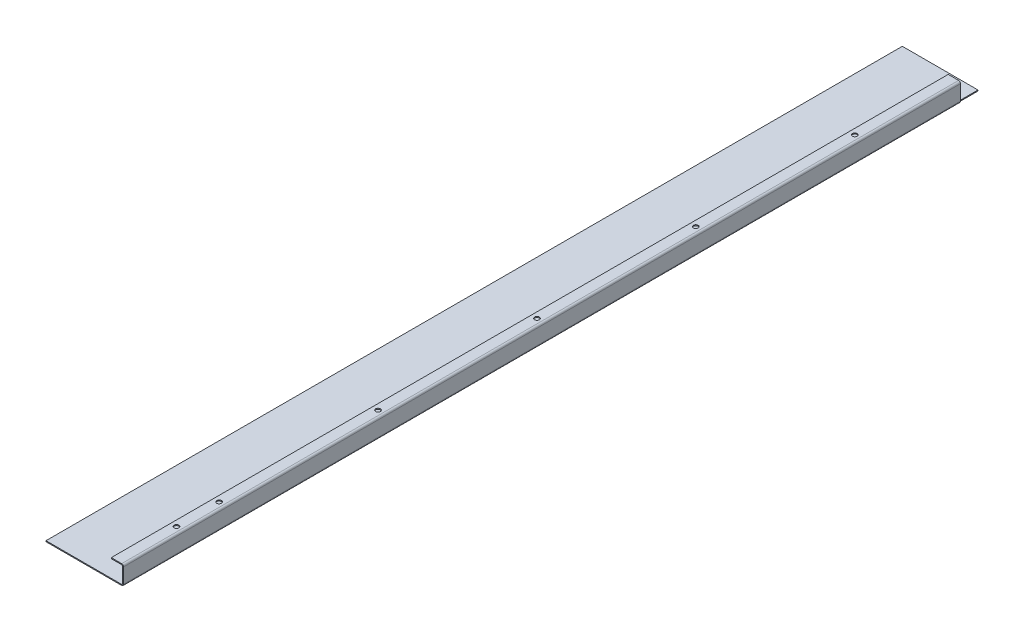
ISO-10303-21;
HEADER;
FILE_DESCRIPTION(('STEP AP214'),'2;1');
FILE_NAME('part.step','',(''),(''),'','','');
FILE_SCHEMA(('AUTOMOTIVE_DESIGN { 1 0 10303 214 1 1 1 1 }'));
ENDSEC;
DATA;
#1=APPLICATION_CONTEXT('core data for automotive mechanical design processes');
#2=APPLICATION_PROTOCOL_DEFINITION('international standard','automotive_design',2000,#1);
#3=PRODUCT_CONTEXT('',#1,'mechanical');
#4=PRODUCT('Part','Part','',(#3));
#5=PRODUCT_RELATED_PRODUCT_CATEGORY('part','',(#4));
#6=PRODUCT_DEFINITION_FORMATION('','',#4);
#7=PRODUCT_DEFINITION_CONTEXT('part definition',#1,'design');
#8=PRODUCT_DEFINITION('design','',#6,#7);
#9=PRODUCT_DEFINITION_SHAPE('','',#8);
#10=(LENGTH_UNIT() NAMED_UNIT(*) SI_UNIT(.MILLI.,.METRE.));
#11=(NAMED_UNIT(*) PLANE_ANGLE_UNIT() SI_UNIT($,.RADIAN.));
#12=(NAMED_UNIT(*) SI_UNIT($,.STERADIAN.) SOLID_ANGLE_UNIT());
#13=UNCERTAINTY_MEASURE_WITH_UNIT(LENGTH_MEASURE(1.E-05),#10,'distance_accuracy_value','');
#14=(GEOMETRIC_REPRESENTATION_CONTEXT(3) GLOBAL_UNCERTAINTY_ASSIGNED_CONTEXT((#13)) GLOBAL_UNIT_ASSIGNED_CONTEXT((#10,
#11,#12)) REPRESENTATION_CONTEXT('',''));
#15=CARTESIAN_POINT('',(0.,0.,0.));
#16=DIRECTION('',(0.,0.,1.));
#17=DIRECTION('',(1.,0.,0.));
#18=AXIS2_PLACEMENT_3D('',#15,#16,#17);
#19=CARTESIAN_POINT('',(82.,-3.02959534033787E-13,0.));
#20=DIRECTION('',(-1.,0.,0.));
#21=DIRECTION('',(0.,-1.,0.));
#22=AXIS2_PLACEMENT_3D('',#19,#20,#21);
#23=PLANE('',#22);
#24=DIRECTION('',(0.,-1.,0.));
#25=VECTOR('',#24,1.);
#26=CARTESIAN_POINT('',(81.9999999999998,0.,-884.7));
#27=LINE('',#26,#25);
#28=CARTESIAN_POINT('',(81.9999999999999,17.,-884.7));
#29=VERTEX_POINT('',#28);
#30=CARTESIAN_POINT('',(81.9999999999997,0.999999999999931,-884.7));
#31=VERTEX_POINT('',#30);
#32=EDGE_CURVE('E353',#29,#31,#27,.T.);
#33=ORIENTED_EDGE('',*,*,#32,.F.);
#34=DIRECTION('',(0.,0.,-1.));
#35=VECTOR('',#34,1.);
#36=CARTESIAN_POINT('',(82.,17.,-905.2));
#37=LINE('',#36,#35);
#38=CARTESIAN_POINT('',(82.,17.,0.));
#39=VERTEX_POINT('',#38);
#40=EDGE_CURVE('E218',#29,#39,#37,.F.);
#41=ORIENTED_EDGE('',*,*,#40,.T.);
#42=DIRECTION('',(0.,-1.,0.));
#43=VECTOR('',#42,1.);
#44=CARTESIAN_POINT('',(82.,-3.02959534033787E-13,0.));
#45=LINE('',#44,#43);
#46=CARTESIAN_POINT('',(82.,0.999999999999983,0.));
#47=VERTEX_POINT('',#46);
#48=EDGE_CURVE('E231',#39,#47,#45,.T.);
#49=ORIENTED_EDGE('',*,*,#48,.T.);
#50=DIRECTION('',(0.,0.,-1.));
#51=VECTOR('',#50,1.);
#52=CARTESIAN_POINT('',(82.,0.999999999999997,0.));
#53=LINE('',#52,#51);
#54=EDGE_CURVE('E237',#31,#47,#53,.F.);
#55=ORIENTED_EDGE('',*,*,#54,.F.);
#56=EDGE_LOOP('',(#33,#41,#49,#55));
#57=FACE_BOUND('',#56,.T.);
#58=ADVANCED_FACE('F80',(#57),#23,.F.);
#59=CARTESIAN_POINT('',(81.,-2.99468052694944E-13,0.));
#60=DIRECTION('',(-1.,0.,0.));
#61=DIRECTION('',(0.,-1.,0.));
#62=AXIS2_PLACEMENT_3D('',#59,#60,#61);
#63=PLANE('',#62);
#64=DIRECTION('',(0.,0.,-1.));
#65=VECTOR('',#64,1.);
#66=CARTESIAN_POINT('',(81.,17.,-905.2));
#67=LINE('',#66,#65);
#68=CARTESIAN_POINT('',(81.,17.,-884.7));
#69=VERTEX_POINT('',#68);
#70=CARTESIAN_POINT('',(81.,17.,0.));
#71=VERTEX_POINT('',#70);
#72=EDGE_CURVE('E225',#69,#71,#67,.F.);
#73=ORIENTED_EDGE('',*,*,#72,.F.);
#74=DIRECTION('',(0.,-1.,0.));
#75=VECTOR('',#74,1.);
#76=CARTESIAN_POINT('',(80.9999999999998,-2.99307484610677E-13,-884.7));
#77=LINE('',#76,#75);
#78=CARTESIAN_POINT('',(80.9999999999998,0.999999999999987,-884.7));
#79=VERTEX_POINT('',#78);
#80=EDGE_CURVE('E354',#69,#79,#77,.T.);
#81=ORIENTED_EDGE('',*,*,#80,.T.);
#82=DIRECTION('',(0.,0.,-1.));
#83=VECTOR('',#82,1.);
#84=CARTESIAN_POINT('',(81.,1.,0.));
#85=LINE('',#84,#83);
#86=CARTESIAN_POINT('',(81.,0.999999999999987,0.));
#87=VERTEX_POINT('',#86);
#88=EDGE_CURVE('E239',#87,#79,#85,.T.);
#89=ORIENTED_EDGE('',*,*,#88,.F.);
#90=DIRECTION('',(0.,1.,0.));
#91=VECTOR('',#90,1.);
#92=CARTESIAN_POINT('',(81.,0.,0.));
#93=LINE('',#92,#91);
#94=EDGE_CURVE('E235',#71,#87,#93,.F.);
#95=ORIENTED_EDGE('',*,*,#94,.F.);
#96=EDGE_LOOP('',(#73,#81,#89,#95));
#97=FACE_BOUND('',#96,.T.);
#98=ADVANCED_FACE('F401',(#97),#63,.T.);
#99=CARTESIAN_POINT('',(79.9999999999999,0.999999999999991,-905.2));
#100=DIRECTION('',(0.,0.,-1.));
#101=DIRECTION('',(1.,0.,0.));
#102=AXIS2_PLACEMENT_3D('',#99,#100,#101);
#103=CYLINDRICAL_SURFACE('',#102,2.00000000000008);
#104=DIRECTION('',(0.,0.,-1.));
#105=VECTOR('',#104,1.);
#106=CARTESIAN_POINT('',(79.9999999999997,-1.00000000000009,-905.2));
#107=LINE('',#106,#105);
#108=CARTESIAN_POINT('',(79.9999999999997,-1.00000000000009,-884.7));
#109=VERTEX_POINT('',#108);
#110=CARTESIAN_POINT('',(79.9999999999998,-1.,0.));
#111=VERTEX_POINT('',#110);
#112=EDGE_CURVE('E105',#109,#111,#107,.F.);
#113=ORIENTED_EDGE('',*,*,#112,.F.);
#114=CARTESIAN_POINT('',(79.9999999999997,0.999999999999907,-884.7));
#115=DIRECTION('',(0.,0.,1.));
#116=DIRECTION('',(1.,0.,0.));
#117=AXIS2_PLACEMENT_3D('',#114,#115,#116);
#118=CIRCLE('',#117,2.);
#119=EDGE_CURVE('E325',#109,#31,#118,.T.);
#120=ORIENTED_EDGE('',*,*,#119,.T.);
#121=ORIENTED_EDGE('',*,*,#54,.T.);
#122=CARTESIAN_POINT('',(79.9999999999999,0.999999999999991,0.));
#123=DIRECTION('',(0.,0.,-1.));
#124=DIRECTION('',(-1.,0.,0.));
#125=AXIS2_PLACEMENT_3D('',#122,#123,#124);
#126=CIRCLE('',#125,2.00000000000008);
#127=EDGE_CURVE('E246',#111,#47,#126,.F.);
#128=ORIENTED_EDGE('',*,*,#127,.F.);
#129=EDGE_LOOP('',(#113,#120,#121,#128));
#130=FACE_BOUND('',#129,.T.);
#131=ADVANCED_FACE('F407',(#130),#103,.T.);
#132=CARTESIAN_POINT('',(79.9999999999999,0.999999999999991,-905.2));
#133=DIRECTION('',(0.,0.,-1.));
#134=DIRECTION('',(1.,0.,0.));
#135=AXIS2_PLACEMENT_3D('',#132,#133,#134);
#136=CYLINDRICAL_SURFACE('',#135,1.00000000000008);
#137=CARTESIAN_POINT('',(79.9999999999997,0.999999999999907,-884.7));
#138=DIRECTION('',(0.,0.,1.));
#139=DIRECTION('',(1.,0.,0.));
#140=AXIS2_PLACEMENT_3D('',#137,#138,#139);
#141=CIRCLE('',#140,1.);
#142=CARTESIAN_POINT('',(79.9999999999998,0.,-884.7));
#143=VERTEX_POINT('',#142);
#144=EDGE_CURVE('E331',#143,#79,#141,.T.);
#145=ORIENTED_EDGE('',*,*,#144,.F.);
#146=DIRECTION('',(0.,0.,-1.));
#147=VECTOR('',#146,1.);
#148=CARTESIAN_POINT('',(79.9999999999998,0.,-905.2));
#149=LINE('',#148,#147);
#150=CARTESIAN_POINT('',(79.9999999999998,0.,0.));
#151=VERTEX_POINT('',#150);
#152=EDGE_CURVE('E234',#143,#151,#149,.F.);
#153=ORIENTED_EDGE('',*,*,#152,.T.);
#154=CARTESIAN_POINT('',(79.9999999999999,0.999999999999991,0.));
#155=DIRECTION('',(0.,0.,-1.));
#156=DIRECTION('',(-1.,0.,0.));
#157=AXIS2_PLACEMENT_3D('',#154,#155,#156);
#158=CIRCLE('',#157,1.00000000000008);
#159=EDGE_CURVE('E250',#151,#87,#158,.F.);
#160=ORIENTED_EDGE('',*,*,#159,.T.);
#161=ORIENTED_EDGE('',*,*,#88,.T.);
#162=EDGE_LOOP('',(#145,#153,#160,#161));
#163=FACE_BOUND('',#162,.T.);
#164=ADVANCED_FACE('F422',(#163),#136,.F.);
#165=CARTESIAN_POINT('',(80.,17.,-905.2));
#166=DIRECTION('',(0.,0.,-1.));
#167=DIRECTION('',(0.,1.,0.));
#168=AXIS2_PLACEMENT_3D('',#165,#166,#167);
#169=CYLINDRICAL_SURFACE('',#168,2.);
#170=ORIENTED_EDGE('',*,*,#40,.F.);
#171=CARTESIAN_POINT('',(80.,17.,-884.7));
#172=DIRECTION('',(0.,0.,1.));
#173=DIRECTION('',(1.,0.,0.));
#174=AXIS2_PLACEMENT_3D('',#171,#172,#173);
#175=CIRCLE('',#174,2.);
#176=CARTESIAN_POINT('',(79.9999999999997,19.0000000000001,-884.7));
#177=VERTEX_POINT('',#176);
#178=EDGE_CURVE('E184',#29,#177,#175,.T.);
#179=ORIENTED_EDGE('',*,*,#178,.T.);
#180=DIRECTION('',(0.,0.,-1.));
#181=VECTOR('',#180,1.);
#182=CARTESIAN_POINT('',(80.0000000000001,19.,0.));
#183=LINE('',#182,#181);
#184=CARTESIAN_POINT('',(80.,19.,0.));
#185=VERTEX_POINT('',#184);
#186=EDGE_CURVE('E210',#177,#185,#183,.F.);
#187=ORIENTED_EDGE('',*,*,#186,.T.);
#188=CARTESIAN_POINT('',(80.,17.,0.));
#189=DIRECTION('',(0.,0.,-1.));
#190=DIRECTION('',(-1.,0.,0.));
#191=AXIS2_PLACEMENT_3D('',#188,#189,#190);
#192=CIRCLE('',#191,2.);
#193=EDGE_CURVE('E220',#39,#185,#192,.F.);
#194=ORIENTED_EDGE('',*,*,#193,.F.);
#195=EDGE_LOOP('',(#170,#179,#187,#194));
#196=FACE_BOUND('',#195,.T.);
#197=ADVANCED_FACE('F426',(#196),#169,.T.);
#198=CARTESIAN_POINT('',(80.,17.,-905.2));
#199=DIRECTION('',(0.,0.,-1.));
#200=DIRECTION('',(0.,1.,0.));
#201=AXIS2_PLACEMENT_3D('',#198,#199,#200);
#202=CYLINDRICAL_SURFACE('',#201,1.);
#203=CARTESIAN_POINT('',(80.,17.,-884.7));
#204=DIRECTION('',(0.,0.,1.));
#205=DIRECTION('',(1.,0.,0.));
#206=AXIS2_PLACEMENT_3D('',#203,#204,#205);
#207=CIRCLE('',#206,1.);
#208=CARTESIAN_POINT('',(80.0000000000001,18.,-884.7));
#209=VERTEX_POINT('',#208);
#210=EDGE_CURVE('E185',#69,#209,#207,.T.);
#211=ORIENTED_EDGE('',*,*,#210,.F.);
#212=ORIENTED_EDGE('',*,*,#72,.T.);
#213=CARTESIAN_POINT('',(80.,17.,0.));
#214=DIRECTION('',(0.,0.,-1.));
#215=DIRECTION('',(-1.,0.,0.));
#216=AXIS2_PLACEMENT_3D('',#213,#214,#215);
#217=CIRCLE('',#216,1.);
#218=CARTESIAN_POINT('',(80.,18.,0.));
#219=VERTEX_POINT('',#218);
#220=EDGE_CURVE('E209',#71,#219,#217,.F.);
#221=ORIENTED_EDGE('',*,*,#220,.T.);
#222=DIRECTION('',(0.,0.,-1.));
#223=VECTOR('',#222,1.);
#224=CARTESIAN_POINT('',(80.0000000000001,18.,0.));
#225=LINE('',#224,#223);
#226=EDGE_CURVE('E201',#219,#209,#225,.T.);
#227=ORIENTED_EDGE('',*,*,#226,.T.);
#228=EDGE_LOOP('',(#211,#212,#221,#227));
#229=FACE_BOUND('',#228,.T.);
#230=ADVANCED_FACE('F207',(#229),#202,.F.);
#231=CARTESIAN_POINT('',(1.40823756520345E-13,19.0000000000006,0.));
#232=DIRECTION('',(0.,-1.,0.));
#233=DIRECTION('',(1.,0.,0.));
#234=AXIS2_PLACEMENT_3D('',#231,#232,#233);
#235=PLANE('',#234);
#236=CARTESIAN_POINT('',(74.9999999999785,19.,-780.));
#237=DIRECTION('',(0.,1.,0.));
#238=DIRECTION('',(-1.,0.,0.));
#239=AXIS2_PLACEMENT_3D('',#236,#237,#238);
#240=CIRCLE('',#239,2.5);
#241=CARTESIAN_POINT('',(72.4999999999785,19.0000000000001,-780.));
#242=VERTEX_POINT('',#241);
#243=EDGE_CURVE('E322',#242,#242,#240,.T.);
#244=ORIENTED_EDGE('',*,*,#243,.F.);
#245=EDGE_LOOP('',(#244));
#246=FACE_BOUND('',#245,.T.);
#247=CARTESIAN_POINT('',(74.9999999999839,19.,-612.));
#248=DIRECTION('',(0.,1.,0.));
#249=DIRECTION('',(-1.,0.,0.));
#250=AXIS2_PLACEMENT_3D('',#247,#248,#249);
#251=CIRCLE('',#250,2.5);
#252=CARTESIAN_POINT('',(72.4999999999839,19.0000000000001,-612.));
#253=VERTEX_POINT('',#252);
#254=EDGE_CURVE('E324',#253,#253,#251,.T.);
#255=ORIENTED_EDGE('',*,*,#254,.F.);
#256=EDGE_LOOP('',(#255));
#257=FACE_BOUND('',#256,.T.);
#258=CARTESIAN_POINT('',(74.9999999999892,19.,-444.));
#259=DIRECTION('',(0.,1.,0.));
#260=DIRECTION('',(-1.,0.,0.));
#261=AXIS2_PLACEMENT_3D('',#258,#259,#260);
#262=CIRCLE('',#261,2.5);
#263=CARTESIAN_POINT('',(72.4999999999892,19.0000000000001,-444.));
#264=VERTEX_POINT('',#263);
#265=EDGE_CURVE('E328',#264,#264,#262,.T.);
#266=ORIENTED_EDGE('',*,*,#265,.F.);
#267=EDGE_LOOP('',(#266));
#268=FACE_BOUND('',#267,.T.);
#269=CARTESIAN_POINT('',(74.9999999999946,19.,-276.));
#270=DIRECTION('',(0.,1.,0.));
#271=DIRECTION('',(-1.,0.,0.));
#272=AXIS2_PLACEMENT_3D('',#269,#270,#271);
#273=CIRCLE('',#272,2.50000000000001);
#274=CARTESIAN_POINT('',(72.4999999999946,19.0000000000001,-276.));
#275=VERTEX_POINT('',#274);
#276=EDGE_CURVE('E372',#275,#275,#273,.T.);
#277=ORIENTED_EDGE('',*,*,#276,.F.);
#278=EDGE_LOOP('',(#277));
#279=FACE_BOUND('',#278,.T.);
#280=CARTESIAN_POINT('',(74.9999999999999,19.,-108.));
#281=DIRECTION('',(0.,1.,0.));
#282=DIRECTION('',(-1.,0.,0.));
#283=AXIS2_PLACEMENT_3D('',#280,#281,#282);
#284=CIRCLE('',#283,2.50000000000001);
#285=CARTESIAN_POINT('',(72.4999999999999,19.0000000000001,-108.));
#286=VERTEX_POINT('',#285);
#287=EDGE_CURVE('E369',#286,#286,#284,.T.);
#288=ORIENTED_EDGE('',*,*,#287,.F.);
#289=EDGE_LOOP('',(#288));
#290=FACE_BOUND('',#289,.T.);
#291=CARTESIAN_POINT('',(74.9999999999999,19.,-63.));
#292=DIRECTION('',(0.,1.,0.));
#293=DIRECTION('',(-1.,0.,0.));
#294=AXIS2_PLACEMENT_3D('',#291,#292,#293);
#295=CIRCLE('',#294,2.5);
#296=CARTESIAN_POINT('',(72.4999999999999,19.0000000000001,-63.));
#297=VERTEX_POINT('',#296);
#298=EDGE_CURVE('E282',#297,#297,#295,.T.);
#299=ORIENTED_EDGE('',*,*,#298,.F.);
#300=EDGE_LOOP('',(#299));
#301=FACE_BOUND('',#300,.T.);
#302=DIRECTION('',(1.,0.,0.));
#303=VECTOR('',#302,1.);
#304=CARTESIAN_POINT('',(-3.46944695195361E-13,19.0000000000004,-884.7));
#305=LINE('',#304,#303);
#306=CARTESIAN_POINT('',(68.9999999999999,19.0000000000001,-884.7));
#307=VERTEX_POINT('',#306);
#308=EDGE_CURVE('E181',#307,#177,#305,.T.);
#309=ORIENTED_EDGE('',*,*,#308,.F.);
#310=DIRECTION('',(0.,0.,1.));
#311=VECTOR('',#310,1.);
#312=CARTESIAN_POINT('',(69.0000000000001,19.0000000000001,0.));
#313=LINE('',#312,#311);
#314=CARTESIAN_POINT('',(69.0000000000001,19.0000000000001,0.));
#315=VERTEX_POINT('',#314);
#316=EDGE_CURVE('E340',#307,#315,#313,.T.);
#317=ORIENTED_EDGE('',*,*,#316,.T.);
#318=DIRECTION('',(1.,0.,0.));
#319=VECTOR('',#318,1.);
#320=CARTESIAN_POINT('',(1.40823756520345E-13,19.0000000000006,0.));
#321=LINE('',#320,#319);
#322=EDGE_CURVE('E337',#315,#185,#321,.T.);
#323=ORIENTED_EDGE('',*,*,#322,.T.);
#324=ORIENTED_EDGE('',*,*,#186,.F.);
#325=EDGE_LOOP('',(#309,#317,#323,#324));
#326=FACE_BOUND('',#325,.T.);
#327=ADVANCED_FACE('F303',(#246,#257,#268,#279,#290,#301,#326),#235,.F.);
#328=CARTESIAN_POINT('',(1.33680225758392E-13,18.0000000000006,0.));
#329=DIRECTION('',(0.,-1.,0.));
#330=DIRECTION('',(1.,0.,0.));
#331=AXIS2_PLACEMENT_3D('',#328,#329,#330);
#332=PLANE('',#331);
#333=CARTESIAN_POINT('',(74.9999999999999,18.,-63.));
#334=DIRECTION('',(0.,-1.,0.));
#335=DIRECTION('',(1.,0.,0.));
#336=AXIS2_PLACEMENT_3D('',#333,#334,#335);
#337=CIRCLE('',#336,2.5);
#338=CARTESIAN_POINT('',(77.4999999999999,18.,-63.));
#339=VERTEX_POINT('',#338);
#340=EDGE_CURVE('E84',#339,#339,#337,.T.);
#341=ORIENTED_EDGE('',*,*,#340,.F.);
#342=EDGE_LOOP('',(#341));
#343=FACE_BOUND('',#342,.T.);
#344=CARTESIAN_POINT('',(74.9999999999999,18.,-108.));
#345=DIRECTION('',(0.,-1.,0.));
#346=DIRECTION('',(1.,0.,0.));
#347=AXIS2_PLACEMENT_3D('',#344,#345,#346);
#348=CIRCLE('',#347,2.50000000000001);
#349=CARTESIAN_POINT('',(77.5,18.,-108.));
#350=VERTEX_POINT('',#349);
#351=EDGE_CURVE('E290',#350,#350,#348,.T.);
#352=ORIENTED_EDGE('',*,*,#351,.F.);
#353=EDGE_LOOP('',(#352));
#354=FACE_BOUND('',#353,.T.);
#355=CARTESIAN_POINT('',(74.9999999999946,18.,-276.));
#356=DIRECTION('',(0.,-1.,0.));
#357=DIRECTION('',(1.,0.,0.));
#358=AXIS2_PLACEMENT_3D('',#355,#356,#357);
#359=CIRCLE('',#358,2.50000000000001);
#360=CARTESIAN_POINT('',(77.4999999999946,18.,-276.));
#361=VERTEX_POINT('',#360);
#362=EDGE_CURVE('E288',#361,#361,#359,.T.);
#363=ORIENTED_EDGE('',*,*,#362,.F.);
#364=EDGE_LOOP('',(#363));
#365=FACE_BOUND('',#364,.T.);
#366=CARTESIAN_POINT('',(74.9999999999892,18.,-444.));
#367=DIRECTION('',(0.,-1.,0.));
#368=DIRECTION('',(1.,0.,0.));
#369=AXIS2_PLACEMENT_3D('',#366,#367,#368);
#370=CIRCLE('',#369,2.5);
#371=CARTESIAN_POINT('',(77.4999999999892,18.,-444.));
#372=VERTEX_POINT('',#371);
#373=EDGE_CURVE('E285',#372,#372,#370,.T.);
#374=ORIENTED_EDGE('',*,*,#373,.F.);
#375=EDGE_LOOP('',(#374));
#376=FACE_BOUND('',#375,.T.);
#377=CARTESIAN_POINT('',(74.9999999999839,18.,-612.));
#378=DIRECTION('',(0.,-1.,0.));
#379=DIRECTION('',(1.,0.,0.));
#380=AXIS2_PLACEMENT_3D('',#377,#378,#379);
#381=CIRCLE('',#380,2.5);
#382=CARTESIAN_POINT('',(77.4999999999839,18.,-612.));
#383=VERTEX_POINT('',#382);
#384=EDGE_CURVE('E281',#383,#383,#381,.T.);
#385=ORIENTED_EDGE('',*,*,#384,.F.);
#386=EDGE_LOOP('',(#385));
#387=FACE_BOUND('',#386,.T.);
#388=CARTESIAN_POINT('',(74.9999999999785,18.,-780.));
#389=DIRECTION('',(0.,-1.,0.));
#390=DIRECTION('',(1.,0.,0.));
#391=AXIS2_PLACEMENT_3D('',#388,#389,#390);
#392=CIRCLE('',#391,2.5);
#393=CARTESIAN_POINT('',(77.4999999999785,18.,-780.));
#394=VERTEX_POINT('',#393);
#395=EDGE_CURVE('E278',#394,#394,#392,.T.);
#396=ORIENTED_EDGE('',*,*,#395,.F.);
#397=EDGE_LOOP('',(#396));
#398=FACE_BOUND('',#397,.T.);
#399=DIRECTION('',(0.,0.,-1.));
#400=VECTOR('',#399,1.);
#401=CARTESIAN_POINT('',(69.0000000000001,18.0000000000001,0.));
#402=LINE('',#401,#400);
#403=CARTESIAN_POINT('',(68.9999999999999,18.0000000000001,-884.7));
#404=VERTEX_POINT('',#403);
#405=CARTESIAN_POINT('',(69.0000000000001,18.0000000000001,0.));
#406=VERTEX_POINT('',#405);
#407=EDGE_CURVE('E203',#404,#406,#402,.F.);
#408=ORIENTED_EDGE('',*,*,#407,.F.);
#409=DIRECTION('',(1.,0.,0.));
#410=VECTOR('',#409,1.);
#411=CARTESIAN_POINT('',(1.33595742037108E-13,18.0000000000006,-884.7));
#412=LINE('',#411,#410);
#413=EDGE_CURVE('E97',#404,#209,#412,.T.);
#414=ORIENTED_EDGE('',*,*,#413,.T.);
#415=ORIENTED_EDGE('',*,*,#226,.F.);
#416=DIRECTION('',(-1.,0.,0.));
#417=VECTOR('',#416,1.);
#418=CARTESIAN_POINT('',(81.0000000000001,18.,0.));
#419=LINE('',#418,#417);
#420=EDGE_CURVE('E342',#406,#219,#419,.F.);
#421=ORIENTED_EDGE('',*,*,#420,.F.);
#422=EDGE_LOOP('',(#408,#414,#415,#421));
#423=FACE_BOUND('',#422,.T.);
#424=ADVANCED_FACE('F199',(#343,#354,#365,#376,#387,#398,#423),#332,.T.);
#425=CARTESIAN_POINT('',(69.0000000000001,19.0000000000001,0.));
#426=DIRECTION('',(1.,0.,0.));
#427=DIRECTION('',(0.,1.,0.));
#428=AXIS2_PLACEMENT_3D('',#425,#426,#427);
#429=PLANE('',#428);
#430=DIRECTION('',(0.,1.,0.));
#431=VECTOR('',#430,1.);
#432=CARTESIAN_POINT('',(68.9999999999999,19.0000000000001,-884.7));
#433=LINE('',#432,#431);
#434=EDGE_CURVE('E204',#307,#404,#433,.F.);
#435=ORIENTED_EDGE('',*,*,#434,.T.);
#436=ORIENTED_EDGE('',*,*,#407,.T.);
#437=DIRECTION('',(0.,-1.,0.));
#438=VECTOR('',#437,1.);
#439=CARTESIAN_POINT('',(69.0000000000001,19.0000000000001,0.));
#440=LINE('',#439,#438);
#441=EDGE_CURVE('E227',#315,#406,#440,.T.);
#442=ORIENTED_EDGE('',*,*,#441,.F.);
#443=ORIENTED_EDGE('',*,*,#316,.F.);
#444=EDGE_LOOP('',(#435,#436,#442,#443));
#445=FACE_BOUND('',#444,.T.);
#446=ADVANCED_FACE('F302',(#445),#429,.F.);
#447=CARTESIAN_POINT('',(82.,0.,0.));
#448=DIRECTION('',(0.,0.,-1.));
#449=DIRECTION('',(-1.,0.,0.));
#450=AXIS2_PLACEMENT_3D('',#447,#448,#449);
#451=PLANE('',#450);
#452=DIRECTION('',(1.,0.,0.));
#453=VECTOR('',#452,1.);
#454=CARTESIAN_POINT('',(81.,17.,0.));
#455=LINE('',#454,#453);
#456=EDGE_CURVE('E223',#71,#39,#455,.T.);
#457=ORIENTED_EDGE('',*,*,#456,.F.);
#458=ORIENTED_EDGE('',*,*,#94,.T.);
#459=DIRECTION('',(-1.,0.,0.));
#460=VECTOR('',#459,1.);
#461=CARTESIAN_POINT('',(82.,0.999999999999997,0.));
#462=LINE('',#461,#460);
#463=EDGE_CURVE('E230',#87,#47,#462,.F.);
#464=ORIENTED_EDGE('',*,*,#463,.T.);
#465=ORIENTED_EDGE('',*,*,#48,.F.);
#466=EDGE_LOOP('',(#457,#458,#464,#465));
#467=FACE_BOUND('',#466,.T.);
#468=ADVANCED_FACE('F415',(#467),#451,.F.);
#469=CARTESIAN_POINT('',(-1.94289029309402E-13,-1.,-905.2));
#470=DIRECTION('',(0.,0.,-1.));
#471=DIRECTION('',(-1.,0.,0.));
#472=AXIS2_PLACEMENT_3D('',#469,#470,#471);
#473=PLANE('',#472);
#474=DIRECTION('',(-1.,0.,0.));
#475=VECTOR('',#474,1.);
#476=CARTESIAN_POINT('',(-1.94289029309402E-13,0.,-905.2));
#477=LINE('',#476,#475);
#478=CARTESIAN_POINT('',(79.9999999999998,0.,-905.2));
#479=VERTEX_POINT('',#478);
#480=CARTESIAN_POINT('',(-1.94289029309402E-13,0.,-905.2));
#481=VERTEX_POINT('',#480);
#482=EDGE_CURVE('E266',#479,#481,#477,.T.);
#483=ORIENTED_EDGE('',*,*,#482,.F.);
#484=DIRECTION('',(0.,-1.,0.));
#485=VECTOR('',#484,1.);
#486=CARTESIAN_POINT('',(79.9999999999998,0.,-905.2));
#487=LINE('',#486,#485);
#488=CARTESIAN_POINT('',(79.9999999999997,-1.00000000000009,-905.2));
#489=VERTEX_POINT('',#488);
#490=EDGE_CURVE('E249',#479,#489,#487,.T.);
#491=ORIENTED_EDGE('',*,*,#490,.T.);
#492=DIRECTION('',(-1.,0.,0.));
#493=VECTOR('',#492,1.);
#494=CARTESIAN_POINT('',(-1.94289029309402E-13,-1.,-905.2));
#495=LINE('',#494,#493);
#496=CARTESIAN_POINT('',(-1.94289029309402E-13,-1.,-905.2));
#497=VERTEX_POINT('',#496);
#498=EDGE_CURVE('E269',#489,#497,#495,.T.);
#499=ORIENTED_EDGE('',*,*,#498,.T.);
#500=DIRECTION('',(0.,1.,0.));
#501=VECTOR('',#500,1.);
#502=CARTESIAN_POINT('',(-1.94289029309402E-13,-1.,-905.2));
#503=LINE('',#502,#501);
#504=EDGE_CURVE('E13',#497,#481,#503,.T.);
#505=ORIENTED_EDGE('',*,*,#504,.T.);
#506=EDGE_LOOP('',(#483,#491,#499,#505));
#507=FACE_BOUND('',#506,.T.);
#508=ADVANCED_FACE('F418',(#507),#473,.T.);
#509=CARTESIAN_POINT('',(0.,-1.,0.));
#510=DIRECTION('',(0.,-1.,0.));
#511=DIRECTION('',(0.,0.,-1.));
#512=AXIS2_PLACEMENT_3D('',#509,#510,#511);
#513=PLANE('',#512);
#514=ORIENTED_EDGE('',*,*,#498,.F.);
#515=EDGE_CURVE('E244',#489,#109,#107,.F.);
#516=ORIENTED_EDGE('',*,*,#515,.T.);
#517=ORIENTED_EDGE('',*,*,#112,.T.);
#518=DIRECTION('',(1.,0.,0.));
#519=VECTOR('',#518,1.);
#520=CARTESIAN_POINT('',(0.,-1.,0.));
#521=LINE('',#520,#519);
#522=CARTESIAN_POINT('',(0.,-1.,0.));
#523=VERTEX_POINT('',#522);
#524=EDGE_CURVE('E265',#523,#111,#521,.T.);
#525=ORIENTED_EDGE('',*,*,#524,.F.);
#526=DIRECTION('',(0.,0.,1.));
#527=VECTOR('',#526,1.);
#528=CARTESIAN_POINT('',(0.,-1.,0.));
#529=LINE('',#528,#527);
#530=EDGE_CURVE('E262',#497,#523,#529,.T.);
#531=ORIENTED_EDGE('',*,*,#530,.F.);
#532=EDGE_LOOP('',(#514,#516,#517,#525,#531));
#533=FACE_BOUND('',#532,.T.);
#534=ADVANCED_FACE('F433',(#533),#513,.T.);
#535=CARTESIAN_POINT('',(0.,0.,0.));
#536=DIRECTION('',(0.,-1.,0.));
#537=DIRECTION('',(0.,0.,-1.));
#538=AXIS2_PLACEMENT_3D('',#535,#536,#537);
#539=PLANE('',#538);
#540=EDGE_CURVE('E253',#479,#143,#149,.F.);
#541=ORIENTED_EDGE('',*,*,#540,.F.);
#542=ORIENTED_EDGE('',*,*,#482,.T.);
#543=DIRECTION('',(0.,0.,1.));
#544=VECTOR('',#543,1.);
#545=CARTESIAN_POINT('',(0.,0.,0.));
#546=LINE('',#545,#544);
#547=CARTESIAN_POINT('',(0.,0.,0.));
#548=VERTEX_POINT('',#547);
#549=EDGE_CURVE('E259',#481,#548,#546,.T.);
#550=ORIENTED_EDGE('',*,*,#549,.T.);
#551=DIRECTION('',(1.,0.,0.));
#552=VECTOR('',#551,1.);
#553=CARTESIAN_POINT('',(0.,0.,0.));
#554=LINE('',#553,#552);
#555=EDGE_CURVE('E273',#548,#151,#554,.T.);
#556=ORIENTED_EDGE('',*,*,#555,.T.);
#557=ORIENTED_EDGE('',*,*,#152,.F.);
#558=EDGE_LOOP('',(#541,#542,#550,#556,#557));
#559=FACE_BOUND('',#558,.T.);
#560=ADVANCED_FACE('F436',(#559),#539,.F.);
#561=CARTESIAN_POINT('',(0.,-1.,0.));
#562=DIRECTION('',(-1.,0.,0.));
#563=DIRECTION('',(0.,0.,1.));
#564=AXIS2_PLACEMENT_3D('',#561,#562,#563);
#565=PLANE('',#564);
#566=ORIENTED_EDGE('',*,*,#549,.F.);
#567=ORIENTED_EDGE('',*,*,#504,.F.);
#568=ORIENTED_EDGE('',*,*,#530,.T.);
#569=DIRECTION('',(0.,1.,0.));
#570=VECTOR('',#569,1.);
#571=CARTESIAN_POINT('',(0.,-1.,0.));
#572=LINE('',#571,#570);
#573=EDGE_CURVE('E89',#523,#548,#572,.T.);
#574=ORIENTED_EDGE('',*,*,#573,.T.);
#575=EDGE_LOOP('',(#566,#567,#568,#574));
#576=FACE_BOUND('',#575,.T.);
#577=ADVANCED_FACE('F82',(#576),#565,.T.);
#578=CARTESIAN_POINT('',(0.,-1.,0.));
#579=DIRECTION('',(0.,0.,1.));
#580=DIRECTION('',(1.,0.,0.));
#581=AXIS2_PLACEMENT_3D('',#578,#579,#580);
#582=PLANE('',#581);
#583=DIRECTION('',(0.,-1.,0.));
#584=VECTOR('',#583,1.);
#585=CARTESIAN_POINT('',(79.9999999999998,0.,0.));
#586=LINE('',#585,#584);
#587=EDGE_CURVE('E256',#151,#111,#586,.T.);
#588=ORIENTED_EDGE('',*,*,#587,.F.);
#589=ORIENTED_EDGE('',*,*,#555,.F.);
#590=ORIENTED_EDGE('',*,*,#573,.F.);
#591=ORIENTED_EDGE('',*,*,#524,.T.);
#592=EDGE_LOOP('',(#588,#589,#590,#591));
#593=FACE_BOUND('',#592,.T.);
#594=ADVANCED_FACE('F431',(#593),#582,.T.);
#595=CARTESIAN_POINT('',(79.9999999999999,0.999999999999991,0.));
#596=DIRECTION('',(0.,0.,1.));
#597=DIRECTION('',(1.,0.,0.));
#598=AXIS2_PLACEMENT_3D('',#595,#596,#597);
#599=PLANE('',#598);
#600=ORIENTED_EDGE('',*,*,#463,.F.);
#601=ORIENTED_EDGE('',*,*,#159,.F.);
#602=ORIENTED_EDGE('',*,*,#587,.T.);
#603=ORIENTED_EDGE('',*,*,#127,.T.);
#604=EDGE_LOOP('',(#600,#601,#602,#603));
#605=FACE_BOUND('',#604,.T.);
#606=ADVANCED_FACE('F428',(#605),#599,.T.);
#607=CARTESIAN_POINT('',(80.,17.,0.));
#608=DIRECTION('',(0.,0.,1.));
#609=DIRECTION('',(1.,0.,0.));
#610=AXIS2_PLACEMENT_3D('',#607,#608,#609);
#611=PLANE('',#610);
#612=DIRECTION('',(0.,-1.,0.));
#613=VECTOR('',#612,1.);
#614=CARTESIAN_POINT('',(80.0000000000001,19.,0.));
#615=LINE('',#614,#613);
#616=EDGE_CURVE('E211',#219,#185,#615,.F.);
#617=ORIENTED_EDGE('',*,*,#616,.F.);
#618=ORIENTED_EDGE('',*,*,#220,.F.);
#619=ORIENTED_EDGE('',*,*,#456,.T.);
#620=ORIENTED_EDGE('',*,*,#193,.T.);
#621=EDGE_LOOP('',(#617,#618,#619,#620));
#622=FACE_BOUND('',#621,.T.);
#623=ADVANCED_FACE('F412',(#622),#611,.T.);
#624=CARTESIAN_POINT('',(81.0000000000001,19.,0.));
#625=DIRECTION('',(0.,0.,-1.));
#626=DIRECTION('',(-1.,0.,0.));
#627=AXIS2_PLACEMENT_3D('',#624,#625,#626);
#628=PLANE('',#627);
#629=ORIENTED_EDGE('',*,*,#616,.T.);
#630=ORIENTED_EDGE('',*,*,#322,.F.);
#631=ORIENTED_EDGE('',*,*,#441,.T.);
#632=ORIENTED_EDGE('',*,*,#420,.T.);
#633=EDGE_LOOP('',(#629,#630,#631,#632));
#634=FACE_BOUND('',#633,.T.);
#635=ADVANCED_FACE('F318',(#634),#628,.F.);
#636=CARTESIAN_POINT('',(74.9999999999784,9.00000000000004,-780.));
#637=DIRECTION('',(0.,1.,0.));
#638=DIRECTION('',(-1.,0.,0.));
#639=AXIS2_PLACEMENT_3D('',#636,#637,#638);
#640=CYLINDRICAL_SURFACE('',#639,2.5);
#641=ORIENTED_EDGE('',*,*,#395,.T.);
#642=EDGE_LOOP('',(#641));
#643=FACE_BOUND('',#642,.T.);
#644=ORIENTED_EDGE('',*,*,#243,.T.);
#645=EDGE_LOOP('',(#644));
#646=FACE_BOUND('',#645,.T.);
#647=ADVANCED_FACE('F314',(#643,#646),#640,.F.);
#648=CARTESIAN_POINT('',(74.9999999999838,9.00000000000004,-612.));
#649=DIRECTION('',(0.,1.,0.));
#650=DIRECTION('',(-1.,0.,0.));
#651=AXIS2_PLACEMENT_3D('',#648,#649,#650);
#652=CYLINDRICAL_SURFACE('',#651,2.5);
#653=ORIENTED_EDGE('',*,*,#384,.T.);
#654=EDGE_LOOP('',(#653));
#655=FACE_BOUND('',#654,.T.);
#656=ORIENTED_EDGE('',*,*,#254,.T.);
#657=EDGE_LOOP('',(#656));
#658=FACE_BOUND('',#657,.T.);
#659=ADVANCED_FACE('F317',(#655,#658),#652,.F.);
#660=CARTESIAN_POINT('',(74.9999999999891,9.00000000000004,-444.));
#661=DIRECTION('',(0.,1.,0.));
#662=DIRECTION('',(-1.,0.,0.));
#663=AXIS2_PLACEMENT_3D('',#660,#661,#662);
#664=CYLINDRICAL_SURFACE('',#663,2.5);
#665=ORIENTED_EDGE('',*,*,#373,.T.);
#666=EDGE_LOOP('',(#665));
#667=FACE_BOUND('',#666,.T.);
#668=ORIENTED_EDGE('',*,*,#265,.T.);
#669=EDGE_LOOP('',(#668));
#670=FACE_BOUND('',#669,.T.);
#671=ADVANCED_FACE('F377',(#667,#670),#664,.F.);
#672=CARTESIAN_POINT('',(74.9999999999945,9.00000000000004,-276.));
#673=DIRECTION('',(0.,1.,0.));
#674=DIRECTION('',(-1.,0.,0.));
#675=AXIS2_PLACEMENT_3D('',#672,#673,#674);
#676=CYLINDRICAL_SURFACE('',#675,2.50000000000001);
#677=ORIENTED_EDGE('',*,*,#362,.T.);
#678=EDGE_LOOP('',(#677));
#679=FACE_BOUND('',#678,.T.);
#680=ORIENTED_EDGE('',*,*,#276,.T.);
#681=EDGE_LOOP('',(#680));
#682=FACE_BOUND('',#681,.T.);
#683=ADVANCED_FACE('F398',(#679,#682),#676,.F.);
#684=CARTESIAN_POINT('',(74.9999999999999,9.00000000000004,-108.));
#685=DIRECTION('',(0.,1.,0.));
#686=DIRECTION('',(-1.,0.,0.));
#687=AXIS2_PLACEMENT_3D('',#684,#685,#686);
#688=CYLINDRICAL_SURFACE('',#687,2.50000000000001);
#689=ORIENTED_EDGE('',*,*,#351,.T.);
#690=EDGE_LOOP('',(#689));
#691=FACE_BOUND('',#690,.T.);
#692=ORIENTED_EDGE('',*,*,#287,.T.);
#693=EDGE_LOOP('',(#692));
#694=FACE_BOUND('',#693,.T.);
#695=ADVANCED_FACE('F389',(#691,#694),#688,.F.);
#696=CARTESIAN_POINT('',(74.9999999999999,9.00000000000004,-63.));
#697=DIRECTION('',(0.,1.,0.));
#698=DIRECTION('',(-1.,0.,0.));
#699=AXIS2_PLACEMENT_3D('',#696,#697,#698);
#700=CYLINDRICAL_SURFACE('',#699,2.5);
#701=ORIENTED_EDGE('',*,*,#340,.T.);
#702=EDGE_LOOP('',(#701));
#703=FACE_BOUND('',#702,.T.);
#704=ORIENTED_EDGE('',*,*,#298,.T.);
#705=EDGE_LOOP('',(#704));
#706=FACE_BOUND('',#705,.T.);
#707=ADVANCED_FACE('F297',(#703,#706),#700,.F.);
#708=CARTESIAN_POINT('',(79.9999999999997,0.999999999999907,-884.7));
#709=DIRECTION('',(0.,0.,-1.));
#710=DIRECTION('',(-1.,0.,0.));
#711=AXIS2_PLACEMENT_3D('',#708,#709,#710);
#712=PLANE('',#711);
#713=DIRECTION('',(0.,-1.,0.));
#714=VECTOR('',#713,1.);
#715=CARTESIAN_POINT('',(79.9999999999999,0.,-884.7));
#716=LINE('',#715,#714);
#717=EDGE_CURVE('E363',#143,#109,#716,.T.);
#718=ORIENTED_EDGE('',*,*,#717,.F.);
#719=ORIENTED_EDGE('',*,*,#144,.T.);
#720=DIRECTION('',(-1.,0.,0.));
#721=VECTOR('',#720,1.);
#722=CARTESIAN_POINT('',(81.9999999999997,0.999999999999931,-884.7));
#723=LINE('',#722,#721);
#724=EDGE_CURVE('E361',#31,#79,#723,.T.);
#725=ORIENTED_EDGE('',*,*,#724,.F.);
#726=ORIENTED_EDGE('',*,*,#119,.F.);
#727=EDGE_LOOP('',(#718,#719,#725,#726));
#728=FACE_BOUND('',#727,.T.);
#729=ADVANCED_FACE('F388',(#728),#712,.T.);
#730=CARTESIAN_POINT('',(79.9999999999998,0.,-894.95));
#731=DIRECTION('',(-1.,0.,0.));
#732=DIRECTION('',(0.,0.,-1.));
#733=AXIS2_PLACEMENT_3D('',#730,#731,#732);
#734=PLANE('',#733);
#735=ORIENTED_EDGE('',*,*,#490,.F.);
#736=ORIENTED_EDGE('',*,*,#540,.T.);
#737=ORIENTED_EDGE('',*,*,#717,.T.);
#738=ORIENTED_EDGE('',*,*,#515,.F.);
#739=EDGE_LOOP('',(#735,#736,#737,#738));
#740=FACE_BOUND('',#739,.T.);
#741=ADVANCED_FACE('F395',(#740),#734,.F.);
#742=CARTESIAN_POINT('',(80.,17.,-884.7));
#743=DIRECTION('',(0.,0.,-1.));
#744=DIRECTION('',(-1.,0.,0.));
#745=AXIS2_PLACEMENT_3D('',#742,#743,#744);
#746=PLANE('',#745);
#747=ORIENTED_EDGE('',*,*,#210,.T.);
#748=DIRECTION('',(0.,-1.,0.));
#749=VECTOR('',#748,1.);
#750=CARTESIAN_POINT('',(79.9999999999997,19.0000000000001,-884.7));
#751=LINE('',#750,#749);
#752=EDGE_CURVE('E177',#177,#209,#751,.T.);
#753=ORIENTED_EDGE('',*,*,#752,.F.);
#754=ORIENTED_EDGE('',*,*,#178,.F.);
#755=DIRECTION('',(-1.,0.,0.));
#756=VECTOR('',#755,1.);
#757=CARTESIAN_POINT('',(81.9999999999999,17.,-884.7));
#758=LINE('',#757,#756);
#759=EDGE_CURVE('E191',#29,#69,#758,.T.);
#760=ORIENTED_EDGE('',*,*,#759,.T.);
#761=EDGE_LOOP('',(#747,#753,#754,#760));
#762=FACE_BOUND('',#761,.T.);
#763=ADVANCED_FACE('F189',(#762),#746,.T.);
#764=CARTESIAN_POINT('',(81.9999999999998,0.,-884.7));
#765=DIRECTION('',(0.,0.,-1.));
#766=DIRECTION('',(0.,-1.,0.));
#767=AXIS2_PLACEMENT_3D('',#764,#765,#766);
#768=PLANE('',#767);
#769=ORIENTED_EDGE('',*,*,#759,.F.);
#770=ORIENTED_EDGE('',*,*,#32,.T.);
#771=ORIENTED_EDGE('',*,*,#724,.T.);
#772=ORIENTED_EDGE('',*,*,#80,.F.);
#773=EDGE_LOOP('',(#769,#770,#771,#772));
#774=FACE_BOUND('',#773,.T.);
#775=ADVANCED_FACE('F472',(#774),#768,.T.);
#776=CARTESIAN_POINT('',(-3.46944695195361E-13,19.0000000000004,-884.7));
#777=DIRECTION('',(0.,0.,-1.));
#778=DIRECTION('',(1.,0.,0.));
#779=AXIS2_PLACEMENT_3D('',#776,#777,#778);
#780=PLANE('',#779);
#781=ORIENTED_EDGE('',*,*,#434,.F.);
#782=ORIENTED_EDGE('',*,*,#308,.T.);
#783=ORIENTED_EDGE('',*,*,#752,.T.);
#784=ORIENTED_EDGE('',*,*,#413,.F.);
#785=EDGE_LOOP('',(#781,#782,#783,#784));
#786=FACE_BOUND('',#785,.T.);
#787=ADVANCED_FACE('F179',(#786),#780,.T.);
#788=CLOSED_SHELL('',(#58,#98,#131,#164,#197,#230,#327,#424,#446,#468,#508,#534,#560,#577,#594,
#606,#623,#635,#647,#659,#671,#683,#695,#707,#729,#741,#763,#775,#787));
#789=MANIFOLD_SOLID_BREP('B2',#788);
#790=ADVANCED_BREP_SHAPE_REPRESENTATION('',(#18,#789),#14);
#791=SHAPE_DEFINITION_REPRESENTATION(#9,#790);
ENDSEC;
END-ISO-10303-21;
